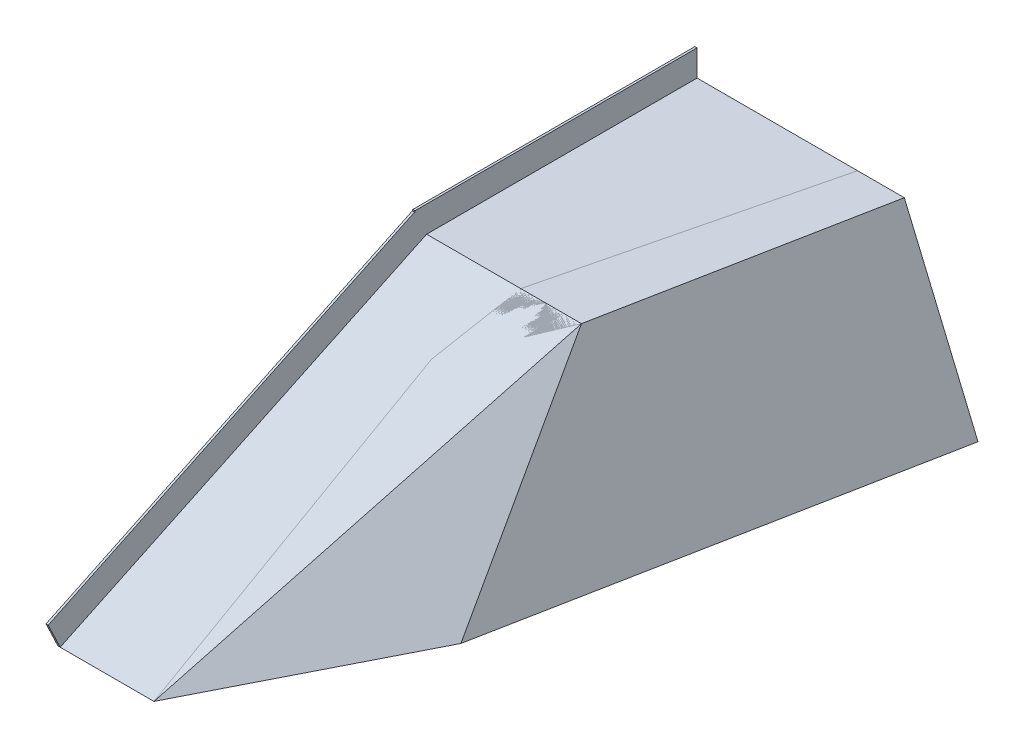
ISO-10303-21;
HEADER;
FILE_DESCRIPTION(('STEP AP214'),'2;1');
FILE_NAME('part.step','',(''),(''),'','','');
FILE_SCHEMA(('AUTOMOTIVE_DESIGN { 1 0 10303 214 1 1 1 1 }'));
ENDSEC;
DATA;
#1=APPLICATION_CONTEXT('core data for automotive mechanical design processes');
#2=APPLICATION_PROTOCOL_DEFINITION('international standard','automotive_design',2000,#1);
#3=PRODUCT_CONTEXT('',#1,'mechanical');
#4=PRODUCT('Part','Part','',(#3));
#5=PRODUCT_RELATED_PRODUCT_CATEGORY('part','',(#4));
#6=PRODUCT_DEFINITION_FORMATION('','',#4);
#7=PRODUCT_DEFINITION_CONTEXT('part definition',#1,'design');
#8=PRODUCT_DEFINITION('design','',#6,#7);
#9=PRODUCT_DEFINITION_SHAPE('','',#8);
#10=(LENGTH_UNIT() NAMED_UNIT(*) SI_UNIT(.MILLI.,.METRE.));
#11=(NAMED_UNIT(*) PLANE_ANGLE_UNIT() SI_UNIT($,.RADIAN.));
#12=(NAMED_UNIT(*) SI_UNIT($,.STERADIAN.) SOLID_ANGLE_UNIT());
#13=UNCERTAINTY_MEASURE_WITH_UNIT(LENGTH_MEASURE(1.E-05),#10,'distance_accuracy_value','');
#14=(GEOMETRIC_REPRESENTATION_CONTEXT(3) GLOBAL_UNCERTAINTY_ASSIGNED_CONTEXT((#13)) GLOBAL_UNIT_ASSIGNED_CONTEXT((#10,
#11,#12)) REPRESENTATION_CONTEXT('',''));
#15=CARTESIAN_POINT('',(0.,0.,0.));
#16=DIRECTION('',(0.,0.,1.));
#17=DIRECTION('',(1.,0.,0.));
#18=AXIS2_PLACEMENT_3D('',#15,#16,#17);
#19=CARTESIAN_POINT('',(229.324151542183,635.,-858.003940670396));
#20=DIRECTION('',(-0.998301207597414,0.,0.0582640447406844));
#21=DIRECTION('',(0.0582640447406844,0.,0.998301207597414));
#22=AXIS2_PLACEMENT_3D('',#19,#20,#21);
#23=PLANE('',#22);
#24=DIRECTION('',(0.0526208176655162,-0.429337935387814,0.901609664314409));
#25=VECTOR('',#24,1.);
#26=CARTESIAN_POINT('',(224.208694015694,450.310778393464,-945.652634626274));
#27=LINE('',#26,#25);
#28=CARTESIAN_POINT('',(229.324151542183,408.573305081141,-858.003940670396));
#29=VERTEX_POINT('',#28);
#30=CARTESIAN_POINT('',(279.4,0.,0.));
#31=VERTEX_POINT('',#30);
#32=EDGE_CURVE('E123',#29,#31,#27,.T.);
#33=ORIENTED_EDGE('',*,*,#32,.F.);
#34=DIRECTION('',(0.,-1.,0.));
#35=VECTOR('',#34,1.);
#36=CARTESIAN_POINT('',(229.324151542183,635.,-858.003940670396));
#37=LINE('',#36,#35);
#38=CARTESIAN_POINT('',(229.324151542183,0.,-858.003940670396));
#39=VERTEX_POINT('',#38);
#40=EDGE_CURVE('E51',#29,#39,#37,.T.);
#41=ORIENTED_EDGE('',*,*,#40,.T.);
#42=DIRECTION('',(-0.0582640447406844,0.,-0.998301207597414));
#43=VECTOR('',#42,1.);
#44=CARTESIAN_POINT('',(229.324151542183,0.,-858.003940670396));
#45=LINE('',#44,#43);
#46=EDGE_CURVE('E126',#31,#39,#45,.T.);
#47=ORIENTED_EDGE('',*,*,#46,.F.);
#48=EDGE_LOOP('',(#33,#41,#47));
#49=FACE_BOUND('',#48,.T.);
#50=ADVANCED_FACE('F48',(#49),#23,.T.);
#51=CARTESIAN_POINT('',(824.163316723663,635.,-1854.2));
#52=DIRECTION('',(0.,0.,-1.));
#53=DIRECTION('',(-1.,0.,0.));
#54=AXIS2_PLACEMENT_3D('',#51,#52,#53);
#55=PLANE('',#54);
#56=DIRECTION('',(-1.,0.,0.));
#57=VECTOR('',#56,1.);
#58=CARTESIAN_POINT('',(824.163316723663,508.,-1854.2));
#59=LINE('',#58,#57);
#60=CARTESIAN_POINT('',(609.6,508.,-1854.2));
#61=VERTEX_POINT('',#60);
#62=CARTESIAN_POINT('',(473.605368522298,508.,-1854.2));
#63=VERTEX_POINT('',#62);
#64=EDGE_CURVE('E96',#61,#63,#59,.T.);
#65=ORIENTED_EDGE('',*,*,#64,.F.);
#66=DIRECTION('',(-0.389086580250754,0.921201190331826,0.));
#67=VECTOR('',#66,1.);
#68=CARTESIAN_POINT('',(596.562158471763,538.868386998671,-1854.2));
#69=LINE('',#68,#67);
#70=CARTESIAN_POINT('',(824.163316723663,0.,-1854.2));
#71=VERTEX_POINT('',#70);
#72=EDGE_CURVE('E107',#71,#61,#69,.T.);
#73=ORIENTED_EDGE('',*,*,#72,.F.);
#74=DIRECTION('',(1.,0.,0.));
#75=VECTOR('',#74,1.);
#76=CARTESIAN_POINT('',(824.163316723663,0.,-1854.2));
#77=LINE('',#76,#75);
#78=CARTESIAN_POINT('',(473.605368522298,0.,-1854.2));
#79=VERTEX_POINT('',#78);
#80=EDGE_CURVE('E132',#79,#71,#77,.T.);
#81=ORIENTED_EDGE('',*,*,#80,.F.);
#82=DIRECTION('',(0.,-1.,0.));
#83=VECTOR('',#82,1.);
#84=CARTESIAN_POINT('',(473.605368522298,635.,-1854.2));
#85=LINE('',#84,#83);
#86=EDGE_CURVE('E12',#63,#79,#85,.T.);
#87=ORIENTED_EDGE('',*,*,#86,.F.);
#88=EDGE_LOOP('',(#65,#73,#81,#87));
#89=FACE_BOUND('',#88,.T.);
#90=ADVANCED_FACE('F106',(#89),#55,.T.);
#91=CARTESIAN_POINT('',(473.605368522298,635.,-1854.2));
#92=DIRECTION('',(-0.971226351797009,0.,-0.238158295205253));
#93=DIRECTION('',(-0.238158295205253,0.,0.971226351797009));
#94=AXIS2_PLACEMENT_3D('',#91,#92,#93);
#95=PLANE('',#94);
#96=DIRECTION('',(-0.238158295205253,0.,0.971226351797009));
#97=VECTOR('',#96,1.);
#98=CARTESIAN_POINT('',(473.605368522298,508.,-1854.2));
#99=LINE('',#98,#97);
#100=CARTESIAN_POINT('',(280.523867698471,508.,-1066.8));
#101=VERTEX_POINT('',#100);
#102=EDGE_CURVE('E109',#63,#101,#99,.T.);
#103=ORIENTED_EDGE('',*,*,#102,.F.);
#104=ORIENTED_EDGE('',*,*,#86,.T.);
#105=DIRECTION('',(0.238158295205253,0.,-0.971226351797009));
#106=VECTOR('',#105,1.);
#107=CARTESIAN_POINT('',(473.605368522298,0.,-1854.2));
#108=LINE('',#107,#106);
#109=EDGE_CURVE('E129',#39,#79,#108,.T.);
#110=ORIENTED_EDGE('',*,*,#109,.F.);
#111=ORIENTED_EDGE('',*,*,#40,.F.);
#112=DIRECTION('',(-0.216159836133399,-0.419769086518788,0.881515081689454));
#113=VECTOR('',#112,1.);
#114=CARTESIAN_POINT('',(451.106859537122,839.26166239117,-1762.44949102146));
#115=LINE('',#114,#113);
#116=EDGE_CURVE('E117',#101,#29,#115,.T.);
#117=ORIENTED_EDGE('',*,*,#116,.F.);
#118=EDGE_LOOP('',(#103,#104,#110,#111,#117));
#119=FACE_BOUND('',#118,.T.);
#120=ADVANCED_FACE('F148',(#119),#95,.T.);
#121=CARTESIAN_POINT('',(0.,0.,0.));
#122=DIRECTION('',(0.,-1.,0.));
#123=DIRECTION('',(0.,0.,-1.));
#124=AXIS2_PLACEMENT_3D('',#121,#122,#123);
#125=PLANE('',#124);
#126=DIRECTION('',(0.190021906565861,0.,-0.981779850590281));
#127=VECTOR('',#126,1.);
#128=CARTESIAN_POINT('',(448.48520298038,0.,86.8035876736222));
#129=LINE('',#128,#127);
#130=CARTESIAN_POINT('',(580.045451773785,0.,-592.924364425635));
#131=VERTEX_POINT('',#130);
#132=EDGE_CURVE('E113',#131,#71,#129,.T.);
#133=ORIENTED_EDGE('',*,*,#132,.F.);
#134=DIRECTION('',(-0.452240599485052,0.,0.891895980581481));
#135=VECTOR('',#134,1.);
#136=CARTESIAN_POINT('',(279.4,0.,0.));
#137=LINE('',#136,#135);
#138=EDGE_CURVE('E134',#131,#31,#137,.T.);
#139=ORIENTED_EDGE('',*,*,#138,.T.);
#140=ORIENTED_EDGE('',*,*,#46,.T.);
#141=ORIENTED_EDGE('',*,*,#109,.T.);
#142=ORIENTED_EDGE('',*,*,#80,.T.);
#143=EDGE_LOOP('',(#133,#139,#140,#141,#142));
#144=FACE_BOUND('',#143,.T.);
#145=ADVANCED_FACE('F137',(#144),#125,.T.);
#146=CARTESIAN_POINT('',(158.02566362996,112.959299077336,80.1277530227725));
#147=DIRECTION('',(-0.752056744720598,-0.537582319217142,-0.381334371366358));
#148=DIRECTION('',(0.581523906275312,-0.813529315040523,0.));
#149=AXIS2_PLACEMENT_3D('',#146,#147,#148);
#150=PLANE('',#149);
#151=ORIENTED_EDGE('',*,*,#138,.F.);
#152=DIRECTION('',(-0.174128370510824,0.720069086337755,-0.671699204617629));
#153=VECTOR('',#152,1.);
#154=CARTESIAN_POINT('',(631.807626871652,-214.050944255857,-393.252066680483));
#155=LINE('',#154,#153);
#156=CARTESIAN_POINT('',(457.2,507.999999999991,-1066.79999999998));
#157=VERTEX_POINT('',#156);
#158=EDGE_CURVE('E102',#131,#157,#155,.T.);
#159=ORIENTED_EDGE('',*,*,#158,.T.);
#160=DIRECTION('',(-0.148801508186848,-0.425147166248137,0.892809049121087));
#161=VECTOR('',#160,1.);
#162=CARTESIAN_POINT('',(273.213556258472,-17.6755535472212,37.1186624491639));
#163=LINE('',#162,#161);
#164=EDGE_CURVE('E114',#157,#31,#163,.T.);
#165=ORIENTED_EDGE('',*,*,#164,.T.);
#166=EDGE_LOOP('',(#151,#159,#165));
#167=FACE_BOUND('',#166,.T.);
#168=ADVANCED_FACE('F143',(#167),#150,.F.);
#169=CARTESIAN_POINT('',(0.,-2.00475307204668E-13,0.));
#170=DIRECTION('',(0.,-0.90286051882393,-0.429933580392348));
#171=DIRECTION('',(0.,0.429933580392348,-0.90286051882393));
#172=AXIS2_PLACEMENT_3D('',#169,#170,#171);
#173=PLANE('',#172);
#174=ORIENTED_EDGE('',*,*,#164,.F.);
#175=DIRECTION('',(-1.,0.,0.));
#176=VECTOR('',#175,1.);
#177=CARTESIAN_POINT('',(0.,508.,-1066.8));
#178=LINE('',#177,#176);
#179=EDGE_CURVE('E98',#157,#101,#178,.T.);
#180=ORIENTED_EDGE('',*,*,#179,.T.);
#181=ORIENTED_EDGE('',*,*,#116,.T.);
#182=ORIENTED_EDGE('',*,*,#32,.T.);
#183=EDGE_LOOP('',(#174,#180,#181,#182));
#184=FACE_BOUND('',#183,.T.);
#185=ADVANCED_FACE('F141',(#184),#173,.F.);
#186=CARTESIAN_POINT('',(382.681643927251,161.632761358848,74.0674149536617));
#187=DIRECTION('',(-0.906898890852564,-0.383045736130585,-0.175528817584368));
#188=DIRECTION('',(0.389086580250754,-0.921201190331826,0.));
#189=AXIS2_PLACEMENT_3D('',#186,#187,#188);
#190=PLANE('',#189);
#191=ORIENTED_EDGE('',*,*,#72,.T.);
#192=DIRECTION('',(0.190021906565862,0.,-0.981779850590281));
#193=VECTOR('',#192,1.);
#194=CARTESIAN_POINT('',(241.669408224673,508.000000000002,46.7747241725169));
#195=LINE('',#194,#193);
#196=EDGE_CURVE('E93',#157,#61,#195,.T.);
#197=ORIENTED_EDGE('',*,*,#196,.F.);
#198=ORIENTED_EDGE('',*,*,#158,.F.);
#199=ORIENTED_EDGE('',*,*,#132,.T.);
#200=EDGE_LOOP('',(#191,#197,#198,#199));
#201=FACE_BOUND('',#200,.T.);
#202=ADVANCED_FACE('F111',(#201),#190,.F.);
#203=CARTESIAN_POINT('',(0.,508.,0.));
#204=DIRECTION('',(0.,-1.,0.));
#205=DIRECTION('',(0.,0.,-1.));
#206=AXIS2_PLACEMENT_3D('',#203,#204,#205);
#207=PLANE('',#206);
#208=ORIENTED_EDGE('',*,*,#64,.T.);
#209=ORIENTED_EDGE('',*,*,#102,.T.);
#210=ORIENTED_EDGE('',*,*,#179,.F.);
#211=ORIENTED_EDGE('',*,*,#196,.T.);
#212=EDGE_LOOP('',(#208,#209,#210,#211));
#213=FACE_BOUND('',#212,.T.);
#214=ADVANCED_FACE('F95',(#213),#207,.F.);
#215=CLOSED_SHELL('',(#50,#90,#120,#145,#168,#185,#202,#214));
#216=MANIFOLD_SOLID_BREP('B2',#215);
#217=CARTESIAN_POINT('',(508.,0.,0.));
#218=DIRECTION('',(0.,-0.90286051882393,-0.429933580392348));
#219=DIRECTION('',(0.,0.429933580392348,-0.90286051882393));
#220=AXIS2_PLACEMENT_3D('',#217,#218,#219);
#221=PLANE('',#220);
#222=DIRECTION('',(0.,0.429933580392348,-0.90286051882393));
#223=VECTOR('',#222,1.);
#224=CARTESIAN_POINT('',(6.35,508.,-1066.8));
#225=LINE('',#224,#223);
#226=CARTESIAN_POINT('',(6.35000000000015,0.,0.));
#227=VERTEX_POINT('',#226);
#228=CARTESIAN_POINT('',(6.34999999999997,508.,-1066.8));
#229=VERTEX_POINT('',#228);
#230=EDGE_CURVE('E231',#227,#229,#225,.T.);
#231=ORIENTED_EDGE('',*,*,#230,.F.);
#232=DIRECTION('',(1.,0.,0.));
#233=VECTOR('',#232,1.);
#234=CARTESIAN_POINT('',(0.,0.,0.));
#235=LINE('',#234,#233);
#236=CARTESIAN_POINT('',(279.4,0.,0.));
#237=VERTEX_POINT('',#236);
#238=EDGE_CURVE('E238',#227,#237,#235,.T.);
#239=ORIENTED_EDGE('',*,*,#238,.T.);
#240=DIRECTION('',(-0.148801508186848,-0.425147166248136,0.892809049121087));
#241=VECTOR('',#240,1.);
#242=CARTESIAN_POINT('',(311.537370085856,91.8210573881609,-192.824220515138));
#243=LINE('',#242,#241);
#244=CARTESIAN_POINT('',(457.2,508.,-1066.8));
#245=VERTEX_POINT('',#244);
#246=EDGE_CURVE('E374',#245,#237,#243,.T.);
#247=ORIENTED_EDGE('',*,*,#246,.F.);
#248=DIRECTION('',(-1.,0.,0.));
#249=VECTOR('',#248,1.);
#250=CARTESIAN_POINT('',(457.2,508.,-1066.8));
#251=LINE('',#250,#249);
#252=EDGE_CURVE('E379',#245,#229,#251,.T.);
#253=ORIENTED_EDGE('',*,*,#252,.T.);
#254=EDGE_LOOP('',(#231,#239,#247,#253));
#255=FACE_BOUND('',#254,.T.);
#256=ADVANCED_FACE('F215',(#255),#221,.F.);
#257=CARTESIAN_POINT('',(0.,584.2,-1032.72074135884));
#258=DIRECTION('',(0.,0.,-1.));
#259=DIRECTION('',(-1.,0.,0.));
#260=AXIS2_PLACEMENT_3D('',#257,#258,#259);
#261=PLANE('',#260);
#262=DIRECTION('',(-1.,0.,0.));
#263=VECTOR('',#262,1.);
#264=CARTESIAN_POINT('',(0.,579.566443146428,-1032.72074135884));
#265=LINE('',#264,#263);
#266=CARTESIAN_POINT('',(6.35,579.566443146428,-1032.72074135884));
#267=VERTEX_POINT('',#266);
#268=CARTESIAN_POINT('',(0.,579.566443146428,-1032.72074135884));
#269=VERTEX_POINT('',#268);
#270=EDGE_CURVE('E320',#267,#269,#265,.T.);
#271=ORIENTED_EDGE('',*,*,#270,.F.);
#272=DIRECTION('',(0.,-1.,0.));
#273=VECTOR('',#272,1.);
#274=CARTESIAN_POINT('',(6.34999999999999,584.2,-1032.72074135884));
#275=LINE('',#274,#273);
#276=CARTESIAN_POINT('',(6.34999999999999,584.2,-1032.72074135884));
#277=VERTEX_POINT('',#276);
#278=EDGE_CURVE('E347',#277,#267,#275,.T.);
#279=ORIENTED_EDGE('',*,*,#278,.F.);
#280=DIRECTION('',(1.,0.,0.));
#281=VECTOR('',#280,1.);
#282=CARTESIAN_POINT('',(0.,584.2,-1032.72074135884));
#283=LINE('',#282,#281);
#284=CARTESIAN_POINT('',(0.,584.2,-1032.72074135884));
#285=VERTEX_POINT('',#284);
#286=EDGE_CURVE('E333',#285,#277,#283,.T.);
#287=ORIENTED_EDGE('',*,*,#286,.F.);
#288=DIRECTION('',(0.,-1.,0.));
#289=VECTOR('',#288,1.);
#290=CARTESIAN_POINT('',(0.,584.2,-1032.72074135884));
#291=LINE('',#290,#289);
#292=EDGE_CURVE('E351',#285,#269,#291,.T.);
#293=ORIENTED_EDGE('',*,*,#292,.T.);
#294=EDGE_LOOP('',(#271,#279,#287,#293));
#295=FACE_BOUND('',#294,.T.);
#296=ADVANCED_FACE('F427',(#295),#261,.F.);
#297=CARTESIAN_POINT('',(0.,508.,0.));
#298=DIRECTION('',(0.,-1.,0.));
#299=DIRECTION('',(0.,0.,-1.));
#300=AXIS2_PLACEMENT_3D('',#297,#298,#299);
#301=PLANE('',#300);
#302=DIRECTION('',(0.,0.,-1.));
#303=VECTOR('',#302,1.);
#304=CARTESIAN_POINT('',(6.34999999999999,508.,-1854.2));
#305=LINE('',#304,#303);
#306=CARTESIAN_POINT('',(6.34999999999999,508.,-1854.2));
#307=VERTEX_POINT('',#306);
#308=EDGE_CURVE('E46',#229,#307,#305,.T.);
#309=ORIENTED_EDGE('',*,*,#308,.F.);
#310=ORIENTED_EDGE('',*,*,#252,.F.);
#311=DIRECTION('',(-0.190021906565861,0.,0.981779850590281));
#312=VECTOR('',#311,1.);
#313=CARTESIAN_POINT('',(609.6,508.,-1854.2));
#314=LINE('',#313,#312);
#315=CARTESIAN_POINT('',(609.6,508.,-1854.2));
#316=VERTEX_POINT('',#315);
#317=EDGE_CURVE('E359',#316,#245,#314,.T.);
#318=ORIENTED_EDGE('',*,*,#317,.F.);
#319=DIRECTION('',(1.,0.,0.));
#320=VECTOR('',#319,1.);
#321=CARTESIAN_POINT('',(0.,508.,-1854.2));
#322=LINE('',#321,#320);
#323=EDGE_CURVE('E356',#307,#316,#322,.T.);
#324=ORIENTED_EDGE('',*,*,#323,.F.);
#325=EDGE_LOOP('',(#309,#310,#318,#324));
#326=FACE_BOUND('',#325,.T.);
#327=ADVANCED_FACE('F408',(#326),#301,.F.);
#328=CARTESIAN_POINT('',(0.,508.,-1066.8));
#329=DIRECTION('',(1.,0.,0.));
#330=DIRECTION('',(0.,0.,-1.));
#331=AXIS2_PLACEMENT_3D('',#328,#329,#330);
#332=PLANE('',#331);
#333=DIRECTION('',(0.,-0.90286051882393,-0.429933580392348));
#334=VECTOR('',#333,1.);
#335=CARTESIAN_POINT('',(0.,581.384502970009,-1031.85499858571));
#336=LINE('',#335,#334);
#337=CARTESIAN_POINT('',(0.,581.384502970009,-1031.85499858571));
#338=VERTEX_POINT('',#337);
#339=EDGE_CURVE('E417',#338,#269,#336,.T.);
#340=ORIENTED_EDGE('',*,*,#339,.T.);
#341=ORIENTED_EDGE('',*,*,#292,.F.);
#342=DIRECTION('',(0.,0.,1.));
#343=VECTOR('',#342,1.);
#344=CARTESIAN_POINT('',(0.,584.2,-1854.2));
#345=LINE('',#344,#343);
#346=CARTESIAN_POINT('',(0.,584.2,-1854.2));
#347=VERTEX_POINT('',#346);
#348=EDGE_CURVE('E324',#347,#285,#345,.T.);
#349=ORIENTED_EDGE('',*,*,#348,.F.);
#350=DIRECTION('',(0.,-1.,0.));
#351=VECTOR('',#350,1.);
#352=CARTESIAN_POINT('',(0.,508.,-1854.2));
#353=LINE('',#352,#351);
#354=CARTESIAN_POINT('',(0.,0.,-1854.2));
#355=VERTEX_POINT('',#354);
#356=EDGE_CURVE('E364',#347,#355,#353,.T.);
#357=ORIENTED_EDGE('',*,*,#356,.T.);
#358=DIRECTION('',(0.,0.,1.));
#359=VECTOR('',#358,1.);
#360=CARTESIAN_POINT('',(0.,0.,-1066.8));
#361=LINE('',#360,#359);
#362=CARTESIAN_POINT('',(0.,0.,0.));
#363=VERTEX_POINT('',#362);
#364=EDGE_CURVE('E317',#355,#363,#361,.T.);
#365=ORIENTED_EDGE('',*,*,#364,.T.);
#366=DIRECTION('',(0.,-0.90286051882393,-0.429933580392348));
#367=VECTOR('',#366,1.);
#368=CARTESIAN_POINT('',(0.,73.3845029700091,34.94500141429));
#369=LINE('',#368,#367);
#370=CARTESIAN_POINT('',(0.,73.3845029700091,34.94500141429));
#371=VERTEX_POINT('',#370);
#372=EDGE_CURVE('E298',#371,#363,#369,.T.);
#373=ORIENTED_EDGE('',*,*,#372,.F.);
#374=DIRECTION('',(0.,-0.429933580392348,0.90286051882393));
#375=VECTOR('',#374,1.);
#376=CARTESIAN_POINT('',(0.,581.384502970009,-1031.85499858571));
#377=LINE('',#376,#375);
#378=EDGE_CURVE('E305',#338,#371,#377,.T.);
#379=ORIENTED_EDGE('',*,*,#378,.F.);
#380=EDGE_LOOP('',(#340,#341,#349,#357,#365,#373,#379));
#381=FACE_BOUND('',#380,.T.);
#382=ADVANCED_FACE('F217',(#381),#332,.F.);
#383=CARTESIAN_POINT('',(279.4,508.,0.));
#384=DIRECTION('',(-0.986393923832144,0.,-0.164398987305357));
#385=DIRECTION('',(-0.164398987305357,0.,0.986393923832144));
#386=AXIS2_PLACEMENT_3D('',#383,#384,#385);
#387=PLANE('',#386);
#388=DIRECTION('',(0.,-1.,0.));
#389=VECTOR('',#388,1.);
#390=CARTESIAN_POINT('',(457.2,508.,-1066.8));
#391=LINE('',#390,#389);
#392=CARTESIAN_POINT('',(457.2,0.,-1066.8));
#393=VERTEX_POINT('',#392);
#394=EDGE_CURVE('E219',#245,#393,#391,.T.);
#395=ORIENTED_EDGE('',*,*,#394,.F.);
#396=ORIENTED_EDGE('',*,*,#246,.T.);
#397=DIRECTION('',(0.164398987305357,0.,-0.986393923832144));
#398=VECTOR('',#397,1.);
#399=CARTESIAN_POINT('',(279.4,0.,0.));
#400=LINE('',#399,#398);
#401=EDGE_CURVE('E383',#237,#393,#400,.T.);
#402=ORIENTED_EDGE('',*,*,#401,.T.);
#403=EDGE_LOOP('',(#395,#396,#402));
#404=FACE_BOUND('',#403,.T.);
#405=ADVANCED_FACE('F393',(#404),#387,.F.);
#406=CARTESIAN_POINT('',(0.,0.,0.));
#407=DIRECTION('',(0.,1.,0.));
#408=DIRECTION('',(0.,0.,1.));
#409=AXIS2_PLACEMENT_3D('',#406,#407,#408);
#410=PLANE('',#409);
#411=ORIENTED_EDGE('',*,*,#364,.F.);
#412=DIRECTION('',(1.,0.,0.));
#413=VECTOR('',#412,1.);
#414=CARTESIAN_POINT('',(0.,0.,-1854.2));
#415=LINE('',#414,#413);
#416=CARTESIAN_POINT('',(609.6,0.,-1854.2));
#417=VERTEX_POINT('',#416);
#418=EDGE_CURVE('E355',#355,#417,#415,.T.);
#419=ORIENTED_EDGE('',*,*,#418,.T.);
#420=DIRECTION('',(-0.190021906565861,0.,0.981779850590281));
#421=VECTOR('',#420,1.);
#422=CARTESIAN_POINT('',(609.6,0.,-1854.2));
#423=LINE('',#422,#421);
#424=EDGE_CURVE('E360',#417,#393,#423,.T.);
#425=ORIENTED_EDGE('',*,*,#424,.T.);
#426=ORIENTED_EDGE('',*,*,#401,.F.);
#427=ORIENTED_EDGE('',*,*,#238,.F.);
#428=EDGE_CURVE('E386',#363,#227,#235,.T.);
#429=ORIENTED_EDGE('',*,*,#428,.F.);
#430=EDGE_LOOP('',(#411,#419,#425,#426,#427,#429));
#431=FACE_BOUND('',#430,.T.);
#432=ADVANCED_FACE('F402',(#431),#410,.F.);
#433=CARTESIAN_POINT('',(609.6,508.,-1854.2));
#434=DIRECTION('',(0.981779850590281,0.,0.190021906565861));
#435=DIRECTION('',(0.190021906565861,0.,-0.981779850590281));
#436=AXIS2_PLACEMENT_3D('',#433,#434,#435);
#437=PLANE('',#436);
#438=ORIENTED_EDGE('',*,*,#424,.F.);
#439=DIRECTION('',(0.,-1.,0.));
#440=VECTOR('',#439,1.);
#441=CARTESIAN_POINT('',(609.6,508.,-1854.2));
#442=LINE('',#441,#440);
#443=EDGE_CURVE('E371',#316,#417,#442,.T.);
#444=ORIENTED_EDGE('',*,*,#443,.F.);
#445=ORIENTED_EDGE('',*,*,#317,.T.);
#446=ORIENTED_EDGE('',*,*,#394,.T.);
#447=EDGE_LOOP('',(#438,#444,#445,#446));
#448=FACE_BOUND('',#447,.T.);
#449=ADVANCED_FACE('F398',(#448),#437,.T.);
#450=CARTESIAN_POINT('',(0.,508.,-1854.2));
#451=DIRECTION('',(0.,0.,-1.));
#452=DIRECTION('',(-1.,0.,0.));
#453=AXIS2_PLACEMENT_3D('',#450,#451,#452);
#454=PLANE('',#453);
#455=ORIENTED_EDGE('',*,*,#418,.F.);
#456=ORIENTED_EDGE('',*,*,#356,.F.);
#457=DIRECTION('',(-1.,0.,0.));
#458=VECTOR('',#457,1.);
#459=CARTESIAN_POINT('',(0.,584.2,-1854.2));
#460=LINE('',#459,#458);
#461=CARTESIAN_POINT('',(6.34999999999999,584.2,-1854.2));
#462=VERTEX_POINT('',#461);
#463=EDGE_CURVE('E339',#462,#347,#460,.T.);
#464=ORIENTED_EDGE('',*,*,#463,.F.);
#465=DIRECTION('',(0.,-1.,0.));
#466=VECTOR('',#465,1.);
#467=CARTESIAN_POINT('',(6.34999999999999,584.2,-1854.2));
#468=LINE('',#467,#466);
#469=EDGE_CURVE('E342',#462,#307,#468,.T.);
#470=ORIENTED_EDGE('',*,*,#469,.T.);
#471=ORIENTED_EDGE('',*,*,#323,.T.);
#472=ORIENTED_EDGE('',*,*,#443,.T.);
#473=EDGE_LOOP('',(#455,#456,#464,#470,#471,#472));
#474=FACE_BOUND('',#473,.T.);
#475=ADVANCED_FACE('F405',(#474),#454,.T.);
#476=CARTESIAN_POINT('',(6.34999999999999,584.2,-1854.2));
#477=DIRECTION('',(-1.,0.,0.));
#478=DIRECTION('',(0.,0.,1.));
#479=AXIS2_PLACEMENT_3D('',#476,#477,#478);
#480=PLANE('',#479);
#481=ORIENTED_EDGE('',*,*,#278,.T.);
#482=DIRECTION('',(0.,-0.90286051882393,-0.429933580392348));
#483=VECTOR('',#482,1.);
#484=CARTESIAN_POINT('',(6.35,581.384502970009,-1031.85499858571));
#485=LINE('',#484,#483);
#486=CARTESIAN_POINT('',(6.35,581.384502970009,-1031.85499858571));
#487=VERTEX_POINT('',#486);
#488=EDGE_CURVE('E326',#487,#267,#485,.T.);
#489=ORIENTED_EDGE('',*,*,#488,.F.);
#490=DIRECTION('',(0.,0.429933580392348,-0.90286051882393));
#491=VECTOR('',#490,1.);
#492=CARTESIAN_POINT('',(6.35,581.384502970009,-1031.85499858571));
#493=LINE('',#492,#491);
#494=CARTESIAN_POINT('',(6.35000000000015,73.3845029700091,34.94500141429));
#495=VERTEX_POINT('',#494);
#496=EDGE_CURVE('E304',#495,#487,#493,.T.);
#497=ORIENTED_EDGE('',*,*,#496,.F.);
#498=DIRECTION('',(0.,-0.90286051882393,-0.429933580392348));
#499=VECTOR('',#498,1.);
#500=CARTESIAN_POINT('',(6.35000000000015,73.3845029700091,34.94500141429));
#501=LINE('',#500,#499);
#502=EDGE_CURVE('E300',#495,#227,#501,.T.);
#503=ORIENTED_EDGE('',*,*,#502,.T.);
#504=ORIENTED_EDGE('',*,*,#230,.T.);
#505=ORIENTED_EDGE('',*,*,#308,.T.);
#506=ORIENTED_EDGE('',*,*,#469,.F.);
#507=DIRECTION('',(0.,0.,-1.));
#508=VECTOR('',#507,1.);
#509=CARTESIAN_POINT('',(6.34999999999999,584.2,-1854.2));
#510=LINE('',#509,#508);
#511=EDGE_CURVE('E336',#277,#462,#510,.T.);
#512=ORIENTED_EDGE('',*,*,#511,.F.);
#513=EDGE_LOOP('',(#481,#489,#497,#503,#504,#505,#506,#512));
#514=FACE_BOUND('',#513,.T.);
#515=ADVANCED_FACE('F412',(#514),#480,.F.);
#516=CARTESIAN_POINT('',(0.,584.2,0.));
#517=DIRECTION('',(0.,1.,0.));
#518=DIRECTION('',(0.,0.,1.));
#519=AXIS2_PLACEMENT_3D('',#516,#517,#518);
#520=PLANE('',#519);
#521=ORIENTED_EDGE('',*,*,#348,.T.);
#522=ORIENTED_EDGE('',*,*,#286,.T.);
#523=ORIENTED_EDGE('',*,*,#511,.T.);
#524=ORIENTED_EDGE('',*,*,#463,.T.);
#525=EDGE_LOOP('',(#521,#522,#523,#524));
#526=FACE_BOUND('',#525,.T.);
#527=ADVANCED_FACE('F432',(#526),#520,.T.);
#528=CARTESIAN_POINT('',(0.,581.384502970009,-1031.85499858571));
#529=DIRECTION('',(0.,-0.429933580392348,0.90286051882393));
#530=DIRECTION('',(0.,-0.90286051882393,-0.429933580392348));
#531=AXIS2_PLACEMENT_3D('',#528,#529,#530);
#532=PLANE('',#531);
#533=ORIENTED_EDGE('',*,*,#488,.T.);
#534=ORIENTED_EDGE('',*,*,#270,.T.);
#535=ORIENTED_EDGE('',*,*,#339,.F.);
#536=DIRECTION('',(-1.,0.,0.));
#537=VECTOR('',#536,1.);
#538=CARTESIAN_POINT('',(0.,581.384502970009,-1031.85499858571));
#539=LINE('',#538,#537);
#540=EDGE_CURVE('E310',#487,#338,#539,.T.);
#541=ORIENTED_EDGE('',*,*,#540,.F.);
#542=EDGE_LOOP('',(#533,#534,#535,#541));
#543=FACE_BOUND('',#542,.T.);
#544=ADVANCED_FACE('F424',(#543),#532,.F.);
#545=CARTESIAN_POINT('',(0.,73.3845029700091,34.94500141429));
#546=DIRECTION('',(0.,0.429933580392348,-0.90286051882393));
#547=DIRECTION('',(0.,0.90286051882393,0.429933580392348));
#548=AXIS2_PLACEMENT_3D('',#545,#546,#547);
#549=PLANE('',#548);
#550=ORIENTED_EDGE('',*,*,#428,.T.);
#551=ORIENTED_EDGE('',*,*,#502,.F.);
#552=DIRECTION('',(1.,0.,0.));
#553=VECTOR('',#552,1.);
#554=CARTESIAN_POINT('',(0.,73.3845029700091,34.94500141429));
#555=LINE('',#554,#553);
#556=EDGE_CURVE('E294',#371,#495,#555,.T.);
#557=ORIENTED_EDGE('',*,*,#556,.F.);
#558=ORIENTED_EDGE('',*,*,#372,.T.);
#559=EDGE_LOOP('',(#550,#551,#557,#558));
#560=FACE_BOUND('',#559,.T.);
#561=ADVANCED_FACE('F296',(#560),#549,.F.);
#562=CARTESIAN_POINT('',(0.,73.3845029700091,34.94500141429));
#563=DIRECTION('',(0.,0.90286051882393,0.429933580392348));
#564=DIRECTION('',(0.,-0.429933580392348,0.90286051882393));
#565=AXIS2_PLACEMENT_3D('',#562,#563,#564);
#566=PLANE('',#565);
#567=ORIENTED_EDGE('',*,*,#378,.T.);
#568=ORIENTED_EDGE('',*,*,#556,.T.);
#569=ORIENTED_EDGE('',*,*,#496,.T.);
#570=ORIENTED_EDGE('',*,*,#540,.T.);
#571=EDGE_LOOP('',(#567,#568,#569,#570));
#572=FACE_BOUND('',#571,.T.);
#573=ADVANCED_FACE('F308',(#572),#566,.T.);
#574=CLOSED_SHELL('',(#256,#296,#327,#382,#405,#432,#449,#475,#515,#527,#544,#561,#573));
#575=MANIFOLD_SOLID_BREP('B6',#574);
#576=ADVANCED_BREP_SHAPE_REPRESENTATION('',(#18,#216,#575),#14);
#577=SHAPE_DEFINITION_REPRESENTATION(#9,#576);
ENDSEC;
END-ISO-10303-21;
